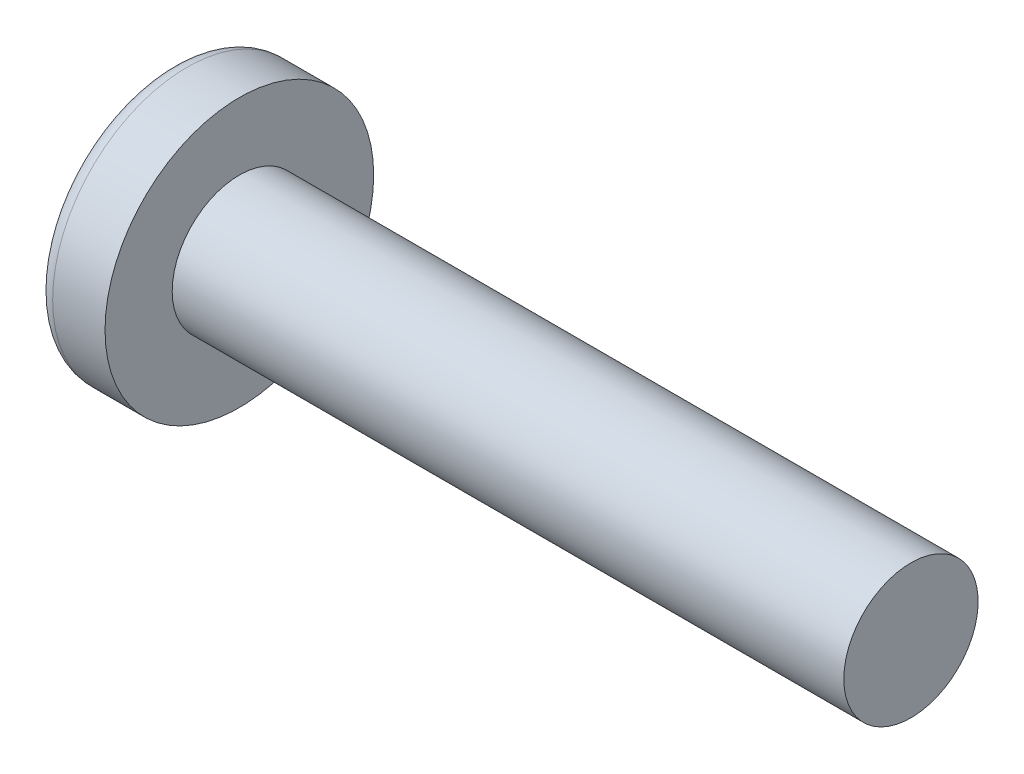
ISO-10303-21;
HEADER;
FILE_DESCRIPTION(('STEP AP214'),'2;1');
FILE_NAME('part.step','',(''),(''),'','','');
FILE_SCHEMA(('AUTOMOTIVE_DESIGN { 1 0 10303 214 1 1 1 1 }'));
ENDSEC;
DATA;
#1=APPLICATION_CONTEXT('core data for automotive mechanical design processes');
#2=APPLICATION_PROTOCOL_DEFINITION('international standard','automotive_design',2000,#1);
#3=PRODUCT_CONTEXT('',#1,'mechanical');
#4=PRODUCT('Part','Part','',(#3));
#5=PRODUCT_RELATED_PRODUCT_CATEGORY('part','',(#4));
#6=PRODUCT_DEFINITION_FORMATION('','',#4);
#7=PRODUCT_DEFINITION_CONTEXT('part definition',#1,'design');
#8=PRODUCT_DEFINITION('design','',#6,#7);
#9=PRODUCT_DEFINITION_SHAPE('','',#8);
#10=(LENGTH_UNIT() NAMED_UNIT(*) SI_UNIT(.MILLI.,.METRE.));
#11=(NAMED_UNIT(*) PLANE_ANGLE_UNIT() SI_UNIT($,.RADIAN.));
#12=(NAMED_UNIT(*) SI_UNIT($,.STERADIAN.) SOLID_ANGLE_UNIT());
#13=UNCERTAINTY_MEASURE_WITH_UNIT(LENGTH_MEASURE(1.E-05),#10,'distance_accuracy_value','');
#14=(GEOMETRIC_REPRESENTATION_CONTEXT(3) GLOBAL_UNCERTAINTY_ASSIGNED_CONTEXT((#13)) GLOBAL_UNIT_ASSIGNED_CONTEXT((#10,
#11,#12)) REPRESENTATION_CONTEXT('',''));
#15=CARTESIAN_POINT('',(0.,0.,0.));
#16=DIRECTION('',(0.,0.,1.));
#17=DIRECTION('',(1.,0.,0.));
#18=AXIS2_PLACEMENT_3D('',#15,#16,#17);
#19=CARTESIAN_POINT('',(3.2,0.,0.));
#20=DIRECTION('',(-1.,0.,0.));
#21=DIRECTION('',(0.,1.,0.));
#22=AXIS2_PLACEMENT_3D('',#19,#20,#21);
#23=SPHERICAL_SURFACE('',#22,3.2);
#24=CARTESIAN_POINT('',(0.62711787578058,0.,0.));
#25=DIRECTION('',(-1.,0.,0.));
#26=DIRECTION('',(0.,0.,1.));
#27=AXIS2_PLACEMENT_3D('',#24,#25,#26);
#28=CIRCLE('',#27,1.9027027027027);
#29=CARTESIAN_POINT('',(0.62711787578058,0.,1.9027027027027));
#30=VERTEX_POINT('',#29);
#31=EDGE_CURVE('E154',#30,#30,#28,.T.);
#32=ORIENTED_EDGE('',*,*,#31,.T.);
#33=EDGE_LOOP('',(#32));
#34=FACE_BOUND('',#33,.T.);
#35=CARTESIAN_POINT('',(3.19174554351625,-0.0818566934638239,0.));
#36=DIRECTION('',(-0.100331502261418,-0.994954064092392,0.));
#37=DIRECTION('',(0.994954064092392,-0.100331502261418,0.));
#38=AXIS2_PLACEMENT_3D('',#35,#36,#37);
#39=CIRCLE('',#38,3.1989422229361);
#40=CARTESIAN_POINT('',(0.118330716626357,0.228067490760365,0.83144431417242));
#41=VERTEX_POINT('',#40);
#42=CARTESIAN_POINT('',(0.0177814447975956,0.238206913129653,0.238206913129654));
#43=VERTEX_POINT('',#42);
#44=EDGE_CURVE('E185',#41,#43,#39,.T.);
#45=ORIENTED_EDGE('',*,*,#44,.F.);
#46=CARTESIAN_POINT('',(2.64043280070581,0.,-0.842892363493775));
#47=DIRECTION('',(0.553083521918191,0.,0.833125811497021));
#48=DIRECTION('',(0.833125811497021,0.,-0.553083521918191));
#49=AXIS2_PLACEMENT_3D('',#46,#47,#48);
#50=CIRCLE('',#49,3.03585523585001);
#51=CARTESIAN_POINT('',(0.118330716626356,-0.22806749076037,0.831444314172418));
#52=VERTEX_POINT('',#51);
#53=EDGE_CURVE('E150',#41,#52,#50,.T.);
#54=ORIENTED_EDGE('',*,*,#53,.T.);
#55=CARTESIAN_POINT('',(3.19174554351625,0.0818566934638237,0.));
#56=DIRECTION('',(-0.100331502261418,0.994954064092392,0.));
#57=DIRECTION('',(-0.994954064092392,-0.100331502261418,0.));
#58=AXIS2_PLACEMENT_3D('',#55,#56,#57);
#59=CIRCLE('',#58,3.1989422229361);
#60=CARTESIAN_POINT('',(0.0177814447975947,-0.238206913129655,0.238206913129654));
#61=VERTEX_POINT('',#60);
#62=EDGE_CURVE('E106',#61,#52,#59,.T.);
#63=ORIENTED_EDGE('',*,*,#62,.F.);
#64=CARTESIAN_POINT('',(3.19174554351625,0.,-0.0818566934638237));
#65=DIRECTION('',(-0.100331502261418,0.,-0.994954064092392));
#66=DIRECTION('',(-0.994954064092392,0.,0.100331502261418));
#67=AXIS2_PLACEMENT_3D('',#64,#65,#66);
#68=CIRCLE('',#67,3.1989422229361);
#69=CARTESIAN_POINT('',(0.118330716626357,-0.831444314172419,0.228067490760367));
#70=VERTEX_POINT('',#69);
#71=EDGE_CURVE('E131',#70,#61,#68,.T.);
#72=ORIENTED_EDGE('',*,*,#71,.F.);
#73=CARTESIAN_POINT('',(2.64043280070581,0.842892363493775,0.));
#74=DIRECTION('',(0.553083521918191,-0.833125811497021,0.));
#75=DIRECTION('',(0.833125811497021,0.553083521918191,0.));
#76=AXIS2_PLACEMENT_3D('',#73,#74,#75);
#77=CIRCLE('',#76,3.03585523585001);
#78=CARTESIAN_POINT('',(0.118330716626356,-0.831444314172419,-0.228067490760367));
#79=VERTEX_POINT('',#78);
#80=EDGE_CURVE('E139',#70,#79,#77,.T.);
#81=ORIENTED_EDGE('',*,*,#80,.T.);
#82=CARTESIAN_POINT('',(3.19174554351625,0.,0.0818566934638239));
#83=DIRECTION('',(-0.100331502261418,0.,0.994954064092392));
#84=DIRECTION('',(0.994954064092392,0.,0.100331502261418));
#85=AXIS2_PLACEMENT_3D('',#82,#83,#84);
#86=CIRCLE('',#85,3.1989422229361);
#87=CARTESIAN_POINT('',(0.0177814447975952,-0.238206913129653,-0.238206913129654));
#88=VERTEX_POINT('',#87);
#89=EDGE_CURVE('E49',#88,#79,#86,.T.);
#90=ORIENTED_EDGE('',*,*,#89,.F.);
#91=CARTESIAN_POINT('',(0.118330716626357,-0.228067490760364,-0.83144431417242));
#92=VERTEX_POINT('',#91);
#93=EDGE_CURVE('E192',#92,#88,#59,.T.);
#94=ORIENTED_EDGE('',*,*,#93,.F.);
#95=CARTESIAN_POINT('',(2.64043280070581,0.,0.842892363493775));
#96=DIRECTION('',(0.553083521918191,0.,-0.833125811497021));
#97=DIRECTION('',(-0.833125811497021,0.,-0.553083521918191));
#98=AXIS2_PLACEMENT_3D('',#95,#96,#97);
#99=CIRCLE('',#98,3.03585523585001);
#100=CARTESIAN_POINT('',(0.118330716626357,0.22806749076037,-0.831444314172418));
#101=VERTEX_POINT('',#100);
#102=EDGE_CURVE('E132',#92,#101,#99,.T.);
#103=ORIENTED_EDGE('',*,*,#102,.T.);
#104=CARTESIAN_POINT('',(0.0177814447975956,0.238206913129655,-0.238206913129654));
#105=VERTEX_POINT('',#104);
#106=EDGE_CURVE('E180',#105,#101,#39,.T.);
#107=ORIENTED_EDGE('',*,*,#106,.F.);
#108=CARTESIAN_POINT('',(0.118330716626356,0.831444314172419,-0.228067490760367));
#109=VERTEX_POINT('',#108);
#110=EDGE_CURVE('E42',#109,#105,#86,.T.);
#111=ORIENTED_EDGE('',*,*,#110,.F.);
#112=CARTESIAN_POINT('',(2.64043280070581,-0.842892363493776,0.));
#113=DIRECTION('',(0.553083521918191,0.833125811497021,0.));
#114=DIRECTION('',(-0.833125811497021,0.553083521918191,0.));
#115=AXIS2_PLACEMENT_3D('',#112,#113,#114);
#116=CIRCLE('',#115,3.03585523585001);
#117=CARTESIAN_POINT('',(0.118330716626357,0.831444314172419,0.228067490760367));
#118=VERTEX_POINT('',#117);
#119=EDGE_CURVE('E11',#109,#118,#116,.T.);
#120=ORIENTED_EDGE('',*,*,#119,.T.);
#121=EDGE_CURVE('E168',#43,#118,#68,.T.);
#122=ORIENTED_EDGE('',*,*,#121,.F.);
#123=EDGE_LOOP('',(#45,#54,#63,#72,#81,#90,#94,#103,#107,#111,#120,#122));
#124=FACE_BOUND('',#123,.T.);
#125=ADVANCED_FACE('F34',(#34,#124),#23,.T.);
#126=CARTESIAN_POINT('',(1.37075949367089,0.,-0.101772151898734));
#127=DIRECTION('',(-0.100331502261418,0.,0.994954064092392));
#128=DIRECTION('',(0.994954064092392,0.,0.100331502261418));
#129=AXIS2_PLACEMENT_3D('',#126,#127,#128);
#130=PLANE('',#129);
#131=ORIENTED_EDGE('',*,*,#110,.T.);
#132=DIRECTION('',(0.989983749746913,-0.0998302940921261,0.0998302940921257));
#133=VECTOR('',#132,1.);
#134=CARTESIAN_POINT('',(1.38081767298512,0.100757881715786,-0.100757881715786));
#135=LINE('',#134,#133);
#136=CARTESIAN_POINT('',(1.19,0.12,-0.12));
#137=VERTEX_POINT('',#136);
#138=EDGE_CURVE('E174',#105,#137,#135,.T.);
#139=ORIENTED_EDGE('',*,*,#138,.T.);
#140=DIRECTION('',(0.830201128729582,-0.551141925795269,0.083717760880294));
#141=VECTOR('',#140,1.);
#142=CARTESIAN_POINT('',(0.,0.91,-0.24));
#143=LINE('',#142,#141);
#144=EDGE_CURVE('E155',#109,#137,#143,.T.);
#145=ORIENTED_EDGE('',*,*,#144,.F.);
#146=EDGE_LOOP('',(#131,#139,#145));
#147=FACE_BOUND('',#146,.T.);
#148=ADVANCED_FACE('F173',(#147),#130,.T.);
#149=DIRECTION('',(0.830201128729582,0.551141925795269,0.083717760880294));
#150=VECTOR('',#149,1.);
#151=CARTESIAN_POINT('',(0.,-0.91,-0.24));
#152=LINE('',#151,#150);
#153=CARTESIAN_POINT('',(1.19,-0.12,-0.12));
#154=VERTEX_POINT('',#153);
#155=EDGE_CURVE('E140',#79,#154,#152,.T.);
#156=ORIENTED_EDGE('',*,*,#155,.T.);
#157=DIRECTION('',(-0.989983749746913,-0.0998302940921253,-0.0998302940921257));
#158=VECTOR('',#157,1.);
#159=CARTESIAN_POINT('',(1.38081767298512,-0.100757881715786,-0.100757881715786));
#160=LINE('',#159,#158);
#161=EDGE_CURVE('E195',#154,#88,#160,.T.);
#162=ORIENTED_EDGE('',*,*,#161,.T.);
#163=ORIENTED_EDGE('',*,*,#89,.T.);
#164=EDGE_LOOP('',(#156,#162,#163));
#165=FACE_BOUND('',#164,.T.);
#166=ADVANCED_FACE('F210',(#165),#130,.T.);
#167=CARTESIAN_POINT('',(1.37075949367089,0.,0.101772151898734));
#168=DIRECTION('',(-0.100331502261418,0.,-0.994954064092392));
#169=DIRECTION('',(-0.994954064092392,0.,0.100331502261418));
#170=AXIS2_PLACEMENT_3D('',#167,#168,#169);
#171=PLANE('',#170);
#172=DIRECTION('',(0.830201128729582,-0.551141925795269,-0.083717760880294));
#173=VECTOR('',#172,1.);
#174=CARTESIAN_POINT('',(0.,0.91,0.24));
#175=LINE('',#174,#173);
#176=CARTESIAN_POINT('',(1.19,0.12,0.12));
#177=VERTEX_POINT('',#176);
#178=EDGE_CURVE('E211',#118,#177,#175,.T.);
#179=ORIENTED_EDGE('',*,*,#178,.T.);
#180=DIRECTION('',(-0.989983749746913,0.0998302940921254,0.0998302940921256));
#181=VECTOR('',#180,1.);
#182=CARTESIAN_POINT('',(1.38081767298512,0.100757881715786,0.100757881715786));
#183=LINE('',#182,#181);
#184=EDGE_CURVE('E189',#177,#43,#183,.T.);
#185=ORIENTED_EDGE('',*,*,#184,.T.);
#186=ORIENTED_EDGE('',*,*,#121,.T.);
#187=EDGE_LOOP('',(#179,#185,#186));
#188=FACE_BOUND('',#187,.T.);
#189=ADVANCED_FACE('F215',(#188),#171,.T.);
#190=ORIENTED_EDGE('',*,*,#71,.T.);
#191=DIRECTION('',(0.989983749746913,0.099830294092126,-0.0998302940921256));
#192=VECTOR('',#191,1.);
#193=CARTESIAN_POINT('',(1.38081767298512,-0.100757881715786,0.100757881715786));
#194=LINE('',#193,#192);
#195=CARTESIAN_POINT('',(1.19,-0.12,0.12));
#196=VERTEX_POINT('',#195);
#197=EDGE_CURVE('E104',#61,#196,#194,.T.);
#198=ORIENTED_EDGE('',*,*,#197,.T.);
#199=DIRECTION('',(0.830201128729582,0.551141925795269,-0.0837177608802938));
#200=VECTOR('',#199,1.);
#201=CARTESIAN_POINT('',(0.,-0.91,0.24));
#202=LINE('',#201,#200);
#203=EDGE_CURVE('E129',#70,#196,#202,.T.);
#204=ORIENTED_EDGE('',*,*,#203,.F.);
#205=EDGE_LOOP('',(#190,#198,#204));
#206=FACE_BOUND('',#205,.T.);
#207=ADVANCED_FACE('F128',(#206),#171,.T.);
#208=CARTESIAN_POINT('',(-25.4,0.,0.));
#209=DIRECTION('',(-1.,0.,0.));
#210=DIRECTION('',(0.,0.,1.));
#211=AXIS2_PLACEMENT_3D('',#208,#209,#210);
#212=CYLINDRICAL_SURFACE('',#211,1.);
#213=CARTESIAN_POINT('',(11.6,0.,0.));
#214=DIRECTION('',(-1.,0.,0.));
#215=DIRECTION('',(0.,0.,1.));
#216=AXIS2_PLACEMENT_3D('',#213,#214,#215);
#217=CIRCLE('',#216,1.);
#218=CARTESIAN_POINT('',(11.6,0.,1.));
#219=VERTEX_POINT('',#218);
#220=EDGE_CURVE('E151',#219,#219,#217,.T.);
#221=ORIENTED_EDGE('',*,*,#220,.T.);
#222=EDGE_LOOP('',(#221));
#223=FACE_BOUND('',#222,.T.);
#224=CARTESIAN_POINT('',(1.6,0.,0.));
#225=DIRECTION('',(-1.,0.,0.));
#226=DIRECTION('',(0.,0.,1.));
#227=AXIS2_PLACEMENT_3D('',#224,#225,#226);
#228=CIRCLE('',#227,1.);
#229=CARTESIAN_POINT('',(1.6,0.,1.));
#230=VERTEX_POINT('',#229);
#231=EDGE_CURVE('E164',#230,#230,#228,.T.);
#232=ORIENTED_EDGE('',*,*,#231,.F.);
#233=EDGE_LOOP('',(#232));
#234=FACE_BOUND('',#233,.T.);
#235=ADVANCED_FACE('F36',(#223,#234),#212,.T.);
#236=CARTESIAN_POINT('',(1.6,1.,0.));
#237=DIRECTION('',(-1.,0.,0.));
#238=DIRECTION('',(0.,0.,1.));
#239=AXIS2_PLACEMENT_3D('',#236,#237,#238);
#240=PLANE('',#239);
#241=CARTESIAN_POINT('',(1.6,0.,0.));
#242=DIRECTION('',(-1.,0.,0.));
#243=DIRECTION('',(0.,0.,1.));
#244=AXIS2_PLACEMENT_3D('',#241,#242,#243);
#245=CIRCLE('',#244,2.);
#246=CARTESIAN_POINT('',(1.6,0.,2.));
#247=VERTEX_POINT('',#246);
#248=EDGE_CURVE('E161',#247,#247,#245,.T.);
#249=ORIENTED_EDGE('',*,*,#248,.F.);
#250=EDGE_LOOP('',(#249));
#251=FACE_BOUND('',#250,.T.);
#252=ORIENTED_EDGE('',*,*,#231,.T.);
#253=EDGE_LOOP('',(#252));
#254=FACE_BOUND('',#253,.T.);
#255=ADVANCED_FACE('F243',(#251,#254),#240,.F.);
#256=CARTESIAN_POINT('',(-25.4,0.,0.));
#257=DIRECTION('',(-1.,0.,0.));
#258=DIRECTION('',(0.,0.,1.));
#259=AXIS2_PLACEMENT_3D('',#256,#257,#258);
#260=CYLINDRICAL_SURFACE('',#259,2.);
#261=ORIENTED_EDGE('',*,*,#248,.T.);
#262=EDGE_LOOP('',(#261));
#263=FACE_BOUND('',#262,.T.);
#264=CARTESIAN_POINT('',(0.820084035097039,0.,0.));
#265=DIRECTION('',(-1.,0.,0.));
#266=DIRECTION('',(0.,0.,1.));
#267=AXIS2_PLACEMENT_3D('',#264,#265,#266);
#268=CIRCLE('',#267,2.);
#269=CARTESIAN_POINT('',(0.820084035097039,0.,2.));
#270=VERTEX_POINT('',#269);
#271=EDGE_CURVE('E158',#270,#270,#268,.T.);
#272=ORIENTED_EDGE('',*,*,#271,.F.);
#273=EDGE_LOOP('',(#272));
#274=FACE_BOUND('',#273,.T.);
#275=ADVANCED_FACE('F240',(#263,#274),#260,.T.);
#276=CARTESIAN_POINT('',(0.820084035097038,0.,0.));
#277=DIRECTION('',(-1.,0.,0.));
#278=DIRECTION('',(0.,0.,1.));
#279=AXIS2_PLACEMENT_3D('',#276,#277,#278);
#280=TOROIDAL_SURFACE('',#279,1.76,0.24);
#281=ORIENTED_EDGE('',*,*,#271,.T.);
#282=EDGE_LOOP('',(#281));
#283=FACE_BOUND('',#282,.T.);
#284=ORIENTED_EDGE('',*,*,#31,.F.);
#285=EDGE_LOOP('',(#284));
#286=FACE_BOUND('',#285,.T.);
#287=ADVANCED_FACE('F237',(#283,#286),#280,.T.);
#288=CARTESIAN_POINT('',(11.6,1.,0.));
#289=DIRECTION('',(1.,0.,0.));
#290=DIRECTION('',(0.,0.,-1.));
#291=AXIS2_PLACEMENT_3D('',#288,#289,#290);
#292=PLANE('',#291);
#293=ORIENTED_EDGE('',*,*,#220,.F.);
#294=EDGE_LOOP('',(#293));
#295=FACE_BOUND('',#294,.T.);
#296=ADVANCED_FACE('F235',(#295),#292,.T.);
#297=CARTESIAN_POINT('',(1.19,0.12,0.12));
#298=DIRECTION('',(0.553083521918191,0.833125811497021,0.));
#299=DIRECTION('',(-0.833125811497021,0.553083521918191,0.));
#300=AXIS2_PLACEMENT_3D('',#297,#298,#299);
#301=PLANE('',#300);
#302=ORIENTED_EDGE('',*,*,#144,.T.);
#303=DIRECTION('',(0.,0.,-1.));
#304=VECTOR('',#303,1.);
#305=CARTESIAN_POINT('',(1.19,0.12,0.12));
#306=LINE('',#305,#304);
#307=EDGE_CURVE('E122',#177,#137,#306,.T.);
#308=ORIENTED_EDGE('',*,*,#307,.F.);
#309=ORIENTED_EDGE('',*,*,#178,.F.);
#310=ORIENTED_EDGE('',*,*,#119,.F.);
#311=EDGE_LOOP('',(#302,#308,#309,#310));
#312=FACE_BOUND('',#311,.T.);
#313=ADVANCED_FACE('F214',(#312),#301,.F.);
#314=CARTESIAN_POINT('',(0.,-0.91,-0.24));
#315=DIRECTION('',(0.553083521918191,-0.833125811497021,0.));
#316=DIRECTION('',(0.833125811497021,0.553083521918191,0.));
#317=AXIS2_PLACEMENT_3D('',#314,#315,#316);
#318=PLANE('',#317);
#319=ORIENTED_EDGE('',*,*,#203,.T.);
#320=DIRECTION('',(0.,0.,1.));
#321=VECTOR('',#320,1.);
#322=CARTESIAN_POINT('',(1.19,-0.12,-0.12));
#323=LINE('',#322,#321);
#324=EDGE_CURVE('E121',#154,#196,#323,.T.);
#325=ORIENTED_EDGE('',*,*,#324,.F.);
#326=ORIENTED_EDGE('',*,*,#155,.F.);
#327=ORIENTED_EDGE('',*,*,#80,.F.);
#328=EDGE_LOOP('',(#319,#325,#326,#327));
#329=FACE_BOUND('',#328,.T.);
#330=ADVANCED_FACE('F136',(#329),#318,.F.);
#331=CARTESIAN_POINT('',(1.19,0.12,-0.12));
#332=DIRECTION('',(-1.,0.,0.));
#333=DIRECTION('',(0.,0.,1.));
#334=AXIS2_PLACEMENT_3D('',#331,#332,#333);
#335=PLANE('',#334);
#336=DIRECTION('',(0.,1.,0.));
#337=VECTOR('',#336,1.);
#338=CARTESIAN_POINT('',(1.19,-0.12,-0.12));
#339=LINE('',#338,#337);
#340=EDGE_CURVE('E144',#154,#137,#339,.T.);
#341=ORIENTED_EDGE('',*,*,#340,.F.);
#342=ORIENTED_EDGE('',*,*,#324,.T.);
#343=DIRECTION('',(0.,-1.,0.));
#344=VECTOR('',#343,1.);
#345=CARTESIAN_POINT('',(1.19,0.12,0.12));
#346=LINE('',#345,#344);
#347=EDGE_CURVE('E113',#177,#196,#346,.T.);
#348=ORIENTED_EDGE('',*,*,#347,.F.);
#349=ORIENTED_EDGE('',*,*,#307,.T.);
#350=EDGE_LOOP('',(#341,#342,#348,#349));
#351=FACE_BOUND('',#350,.T.);
#352=ADVANCED_FACE('F142',(#351),#335,.T.);
#353=CARTESIAN_POINT('',(0.,0.240000000000003,-0.909999999999999));
#354=DIRECTION('',(0.553083521918191,0.,-0.833125811497021));
#355=DIRECTION('',(0.833125811497021,0.,0.553083521918191));
#356=AXIS2_PLACEMENT_3D('',#353,#354,#355);
#357=PLANE('',#356);
#358=DIRECTION('',(0.830201128729582,0.0837177608802919,0.551141925795269));
#359=VECTOR('',#358,1.);
#360=CARTESIAN_POINT('',(0.,-0.239999999999997,-0.910000000000001));
#361=LINE('',#360,#359);
#362=EDGE_CURVE('E200',#92,#154,#361,.T.);
#363=ORIENTED_EDGE('',*,*,#362,.T.);
#364=ORIENTED_EDGE('',*,*,#340,.T.);
#365=DIRECTION('',(0.830201128729582,-0.0837177608802959,0.551141925795269));
#366=VECTOR('',#365,1.);
#367=CARTESIAN_POINT('',(0.,0.240000000000003,-0.909999999999999));
#368=LINE('',#367,#366);
#369=EDGE_CURVE('E110',#101,#137,#368,.T.);
#370=ORIENTED_EDGE('',*,*,#369,.F.);
#371=ORIENTED_EDGE('',*,*,#102,.F.);
#372=EDGE_LOOP('',(#363,#364,#370,#371));
#373=FACE_BOUND('',#372,.T.);
#374=ADVANCED_FACE('F205',(#373),#357,.F.);
#375=CARTESIAN_POINT('',(1.37075949367089,-0.101772151898734,0.));
#376=DIRECTION('',(-0.100331502261418,0.994954064092392,0.));
#377=DIRECTION('',(-0.994954064092392,-0.100331502261418,0.));
#378=AXIS2_PLACEMENT_3D('',#375,#376,#377);
#379=PLANE('',#378);
#380=ORIENTED_EDGE('',*,*,#93,.T.);
#381=ORIENTED_EDGE('',*,*,#161,.F.);
#382=ORIENTED_EDGE('',*,*,#362,.F.);
#383=EDGE_LOOP('',(#380,#381,#382));
#384=FACE_BOUND('',#383,.T.);
#385=ADVANCED_FACE('F209',(#384),#379,.T.);
#386=CARTESIAN_POINT('',(1.37075949367089,0.101772151898734,0.));
#387=DIRECTION('',(-0.100331502261418,-0.994954064092392,0.));
#388=DIRECTION('',(0.994954064092392,-0.100331502261418,0.));
#389=AXIS2_PLACEMENT_3D('',#386,#387,#388);
#390=PLANE('',#389);
#391=ORIENTED_EDGE('',*,*,#106,.T.);
#392=ORIENTED_EDGE('',*,*,#369,.T.);
#393=ORIENTED_EDGE('',*,*,#138,.F.);
#394=EDGE_LOOP('',(#391,#392,#393));
#395=FACE_BOUND('',#394,.T.);
#396=ADVANCED_FACE('F203',(#395),#390,.T.);
#397=CARTESIAN_POINT('',(1.19,-0.12,0.12));
#398=DIRECTION('',(0.553083521918191,0.,0.833125811497021));
#399=DIRECTION('',(-0.833125811497021,0.,0.553083521918191));
#400=AXIS2_PLACEMENT_3D('',#397,#398,#399);
#401=PLANE('',#400);
#402=DIRECTION('',(0.830201128729582,-0.0837177608802921,-0.551141925795269));
#403=VECTOR('',#402,1.);
#404=CARTESIAN_POINT('',(0.,0.239999999999997,0.910000000000001));
#405=LINE('',#404,#403);
#406=EDGE_CURVE('E109',#41,#177,#405,.T.);
#407=ORIENTED_EDGE('',*,*,#406,.T.);
#408=ORIENTED_EDGE('',*,*,#347,.T.);
#409=DIRECTION('',(0.830201128729582,0.0837177608802959,-0.551141925795269));
#410=VECTOR('',#409,1.);
#411=CARTESIAN_POINT('',(0.,-0.240000000000003,0.909999999999999));
#412=LINE('',#411,#410);
#413=EDGE_CURVE('E100',#52,#196,#412,.T.);
#414=ORIENTED_EDGE('',*,*,#413,.F.);
#415=ORIENTED_EDGE('',*,*,#53,.F.);
#416=EDGE_LOOP('',(#407,#408,#414,#415));
#417=FACE_BOUND('',#416,.T.);
#418=ADVANCED_FACE('F114',(#417),#401,.F.);
#419=ORIENTED_EDGE('',*,*,#44,.T.);
#420=ORIENTED_EDGE('',*,*,#184,.F.);
#421=ORIENTED_EDGE('',*,*,#406,.F.);
#422=EDGE_LOOP('',(#419,#420,#421));
#423=FACE_BOUND('',#422,.T.);
#424=ADVANCED_FACE('F216',(#423),#390,.T.);
#425=ORIENTED_EDGE('',*,*,#62,.T.);
#426=ORIENTED_EDGE('',*,*,#413,.T.);
#427=ORIENTED_EDGE('',*,*,#197,.F.);
#428=EDGE_LOOP('',(#425,#426,#427));
#429=FACE_BOUND('',#428,.T.);
#430=ADVANCED_FACE('F102',(#429),#379,.T.);
#431=CLOSED_SHELL('',(#125,#148,#166,#189,#207,#235,#255,#275,#287,#296,#313,#330,#352,#374,
#385,#396,#418,#424,#430));
#432=MANIFOLD_SOLID_BREP('B2',#431);
#433=ADVANCED_BREP_SHAPE_REPRESENTATION('',(#18,#432),#14);
#434=SHAPE_DEFINITION_REPRESENTATION(#9,#433);
ENDSEC;
END-ISO-10303-21;
